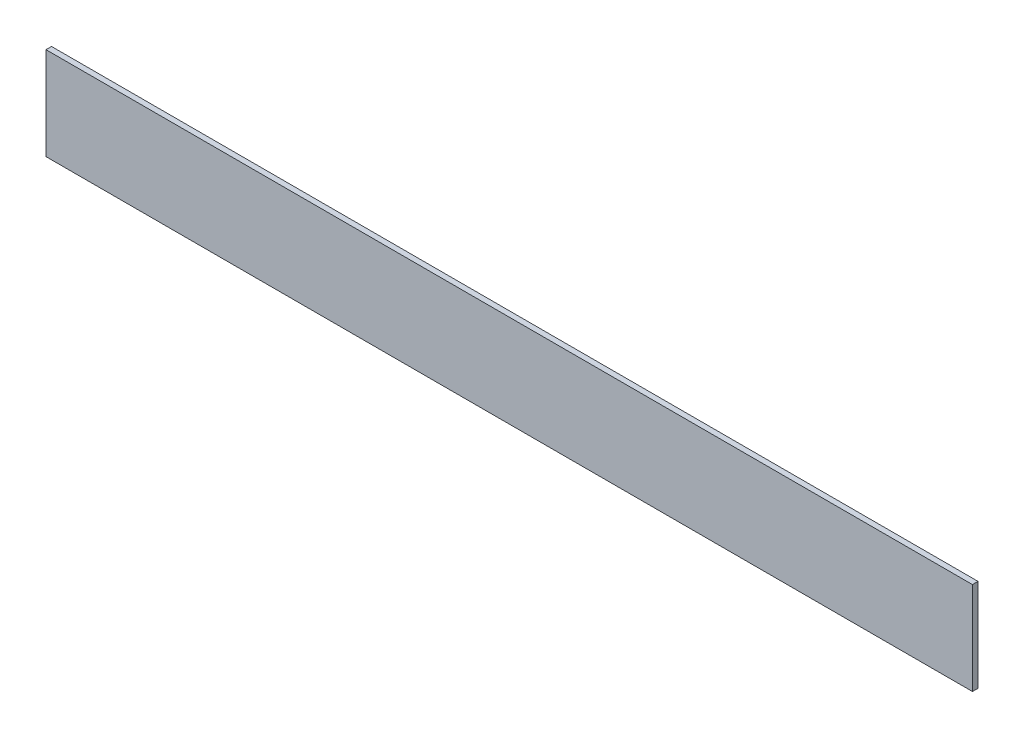
ISO-10303-21;
HEADER;
FILE_DESCRIPTION(('STEP AP214'),'2;1');
FILE_NAME('part.step','',(''),(''),'','','');
FILE_SCHEMA(('AUTOMOTIVE_DESIGN { 1 0 10303 214 1 1 1 1 }'));
ENDSEC;
DATA;
#1=APPLICATION_CONTEXT('core data for automotive mechanical design processes');
#2=APPLICATION_PROTOCOL_DEFINITION('international standard','automotive_design',2000,#1);
#3=PRODUCT_CONTEXT('',#1,'mechanical');
#4=PRODUCT('Part','Part','',(#3));
#5=PRODUCT_RELATED_PRODUCT_CATEGORY('part','',(#4));
#6=PRODUCT_DEFINITION_FORMATION('','',#4);
#7=PRODUCT_DEFINITION_CONTEXT('part definition',#1,'design');
#8=PRODUCT_DEFINITION('design','',#6,#7);
#9=PRODUCT_DEFINITION_SHAPE('','',#8);
#10=(LENGTH_UNIT() NAMED_UNIT(*) SI_UNIT(.MILLI.,.METRE.));
#11=(NAMED_UNIT(*) PLANE_ANGLE_UNIT() SI_UNIT($,.RADIAN.));
#12=(NAMED_UNIT(*) SI_UNIT($,.STERADIAN.) SOLID_ANGLE_UNIT());
#13=UNCERTAINTY_MEASURE_WITH_UNIT(LENGTH_MEASURE(1.E-05),#10,'distance_accuracy_value','');
#14=(GEOMETRIC_REPRESENTATION_CONTEXT(3) GLOBAL_UNCERTAINTY_ASSIGNED_CONTEXT((#13)) GLOBAL_UNIT_ASSIGNED_CONTEXT((#10,
#11,#12)) REPRESENTATION_CONTEXT('',''));
#15=CARTESIAN_POINT('',(0.,0.,0.));
#16=DIRECTION('',(0.,0.,1.));
#17=DIRECTION('',(1.,0.,0.));
#18=AXIS2_PLACEMENT_3D('',#15,#16,#17);
#19=CARTESIAN_POINT('',(760.842096889634,19.4529187817259,3.));
#20=DIRECTION('',(-1.,0.,0.));
#21=DIRECTION('',(0.,0.,1.));
#22=AXIS2_PLACEMENT_3D('',#19,#20,#21);
#23=PLANE('',#22);
#24=DIRECTION('',(0.,1.,0.));
#25=VECTOR('',#24,1.);
#26=CARTESIAN_POINT('',(760.842096889634,19.4529187817259,0.));
#27=LINE('',#26,#25);
#28=CARTESIAN_POINT('',(760.842096889634,-30.5470812182741,0.));
#29=VERTEX_POINT('',#28);
#30=CARTESIAN_POINT('',(760.842096889634,19.4529187817259,0.));
#31=VERTEX_POINT('',#30);
#32=EDGE_CURVE('E96',#29,#31,#27,.T.);
#33=ORIENTED_EDGE('',*,*,#32,.T.);
#34=DIRECTION('',(0.,0.,-1.));
#35=VECTOR('',#34,1.);
#36=CARTESIAN_POINT('',(760.842096889634,19.4529187817259,3.));
#37=LINE('',#36,#35);
#38=CARTESIAN_POINT('',(760.842096889634,19.4529187817259,3.));
#39=VERTEX_POINT('',#38);
#40=EDGE_CURVE('E11',#39,#31,#37,.T.);
#41=ORIENTED_EDGE('',*,*,#40,.F.);
#42=DIRECTION('',(0.,1.,0.));
#43=VECTOR('',#42,1.);
#44=CARTESIAN_POINT('',(760.842096889634,19.4529187817259,3.));
#45=LINE('',#44,#43);
#46=CARTESIAN_POINT('',(760.842096889634,-30.5470812182741,3.));
#47=VERTEX_POINT('',#46);
#48=EDGE_CURVE('E84',#47,#39,#45,.T.);
#49=ORIENTED_EDGE('',*,*,#48,.F.);
#50=DIRECTION('',(0.,0.,-1.));
#51=VECTOR('',#50,1.);
#52=CARTESIAN_POINT('',(760.842096889634,-30.5470812182741,3.));
#53=LINE('',#52,#51);
#54=EDGE_CURVE('E92',#47,#29,#53,.T.);
#55=ORIENTED_EDGE('',*,*,#54,.T.);
#56=EDGE_LOOP('',(#33,#41,#49,#55));
#57=FACE_BOUND('',#56,.T.);
#58=ADVANCED_FACE('F33',(#57),#23,.F.);
#59=CARTESIAN_POINT('',(760.842096889634,19.4529187817259,3.));
#60=DIRECTION('',(0.,-1.,0.));
#61=DIRECTION('',(1.,0.,0.));
#62=AXIS2_PLACEMENT_3D('',#59,#60,#61);
#63=PLANE('',#62);
#64=DIRECTION('',(-1.,0.,0.));
#65=VECTOR('',#64,1.);
#66=CARTESIAN_POINT('',(760.842096889634,19.4529187817259,0.));
#67=LINE('',#66,#65);
#68=CARTESIAN_POINT('',(260.842096889634,19.4529187817258,0.));
#69=VERTEX_POINT('',#68);
#70=EDGE_CURVE('E88',#31,#69,#67,.T.);
#71=ORIENTED_EDGE('',*,*,#70,.T.);
#72=DIRECTION('',(0.,0.,-1.));
#73=VECTOR('',#72,1.);
#74=CARTESIAN_POINT('',(260.842096889634,19.4529187817258,3.));
#75=LINE('',#74,#73);
#76=CARTESIAN_POINT('',(260.842096889634,19.4529187817258,3.));
#77=VERTEX_POINT('',#76);
#78=EDGE_CURVE('E41',#77,#69,#75,.T.);
#79=ORIENTED_EDGE('',*,*,#78,.F.);
#80=DIRECTION('',(-1.,0.,0.));
#81=VECTOR('',#80,1.);
#82=CARTESIAN_POINT('',(760.842096889634,19.4529187817259,3.));
#83=LINE('',#82,#81);
#84=EDGE_CURVE('E79',#39,#77,#83,.T.);
#85=ORIENTED_EDGE('',*,*,#84,.F.);
#86=ORIENTED_EDGE('',*,*,#40,.T.);
#87=EDGE_LOOP('',(#71,#79,#85,#86));
#88=FACE_BOUND('',#87,.T.);
#89=ADVANCED_FACE('F87',(#88),#63,.F.);
#90=CARTESIAN_POINT('',(260.842096889634,19.4529187817258,3.));
#91=DIRECTION('',(1.,0.,0.));
#92=DIRECTION('',(0.,1.,0.));
#93=AXIS2_PLACEMENT_3D('',#90,#91,#92);
#94=PLANE('',#93);
#95=DIRECTION('',(0.,-1.,0.));
#96=VECTOR('',#95,1.);
#97=CARTESIAN_POINT('',(260.842096889634,19.4529187817258,0.));
#98=LINE('',#97,#96);
#99=CARTESIAN_POINT('',(260.842096889634,-30.5470812182741,0.));
#100=VERTEX_POINT('',#99);
#101=EDGE_CURVE('E66',#69,#100,#98,.T.);
#102=ORIENTED_EDGE('',*,*,#101,.T.);
#103=DIRECTION('',(0.,0.,-1.));
#104=VECTOR('',#103,1.);
#105=CARTESIAN_POINT('',(260.842096889634,-30.5470812182741,3.));
#106=LINE('',#105,#104);
#107=CARTESIAN_POINT('',(260.842096889634,-30.5470812182741,3.));
#108=VERTEX_POINT('',#107);
#109=EDGE_CURVE('E89',#108,#100,#106,.T.);
#110=ORIENTED_EDGE('',*,*,#109,.F.);
#111=DIRECTION('',(0.,-1.,0.));
#112=VECTOR('',#111,1.);
#113=CARTESIAN_POINT('',(260.842096889634,19.4529187817258,3.));
#114=LINE('',#113,#112);
#115=EDGE_CURVE('E82',#77,#108,#114,.T.);
#116=ORIENTED_EDGE('',*,*,#115,.F.);
#117=ORIENTED_EDGE('',*,*,#78,.T.);
#118=EDGE_LOOP('',(#102,#110,#116,#117));
#119=FACE_BOUND('',#118,.T.);
#120=ADVANCED_FACE('F90',(#119),#94,.F.);
#121=CARTESIAN_POINT('',(260.842096889634,-30.5470812182741,3.));
#122=DIRECTION('',(0.,1.,0.));
#123=DIRECTION('',(0.,0.,1.));
#124=AXIS2_PLACEMENT_3D('',#121,#122,#123);
#125=PLANE('',#124);
#126=DIRECTION('',(1.,0.,0.));
#127=VECTOR('',#126,1.);
#128=CARTESIAN_POINT('',(260.842096889634,-30.5470812182741,0.));
#129=LINE('',#128,#127);
#130=EDGE_CURVE('E72',#100,#29,#129,.T.);
#131=ORIENTED_EDGE('',*,*,#130,.T.);
#132=ORIENTED_EDGE('',*,*,#54,.F.);
#133=DIRECTION('',(1.,0.,0.));
#134=VECTOR('',#133,1.);
#135=CARTESIAN_POINT('',(260.842096889634,-30.5470812182741,3.));
#136=LINE('',#135,#134);
#137=EDGE_CURVE('E49',#108,#47,#136,.T.);
#138=ORIENTED_EDGE('',*,*,#137,.F.);
#139=ORIENTED_EDGE('',*,*,#109,.T.);
#140=EDGE_LOOP('',(#131,#132,#138,#139));
#141=FACE_BOUND('',#140,.T.);
#142=ADVANCED_FACE('F103',(#141),#125,.F.);
#143=CARTESIAN_POINT('',(0.,0.,3.));
#144=DIRECTION('',(0.,0.,1.));
#145=DIRECTION('',(1.,0.,0.));
#146=AXIS2_PLACEMENT_3D('',#143,#144,#145);
#147=PLANE('',#146);
#148=ORIENTED_EDGE('',*,*,#48,.T.);
#149=ORIENTED_EDGE('',*,*,#84,.T.);
#150=ORIENTED_EDGE('',*,*,#115,.T.);
#151=ORIENTED_EDGE('',*,*,#137,.T.);
#152=EDGE_LOOP('',(#148,#149,#150,#151));
#153=FACE_BOUND('',#152,.T.);
#154=ADVANCED_FACE('F80',(#153),#147,.T.);
#155=CARTESIAN_POINT('',(0.,0.,0.));
#156=DIRECTION('',(0.,0.,1.));
#157=DIRECTION('',(1.,0.,0.));
#158=AXIS2_PLACEMENT_3D('',#155,#156,#157);
#159=PLANE('',#158);
#160=ORIENTED_EDGE('',*,*,#32,.F.);
#161=ORIENTED_EDGE('',*,*,#130,.F.);
#162=ORIENTED_EDGE('',*,*,#101,.F.);
#163=ORIENTED_EDGE('',*,*,#70,.F.);
#164=EDGE_LOOP('',(#160,#161,#162,#163));
#165=FACE_BOUND('',#164,.T.);
#166=ADVANCED_FACE('F106',(#165),#159,.F.);
#167=CLOSED_SHELL('',(#58,#89,#120,#142,#154,#166));
#168=MANIFOLD_SOLID_BREP('B2',#167);
#169=ADVANCED_BREP_SHAPE_REPRESENTATION('',(#18,#168),#14);
#170=SHAPE_DEFINITION_REPRESENTATION(#9,#169);
ENDSEC;
END-ISO-10303-21;
